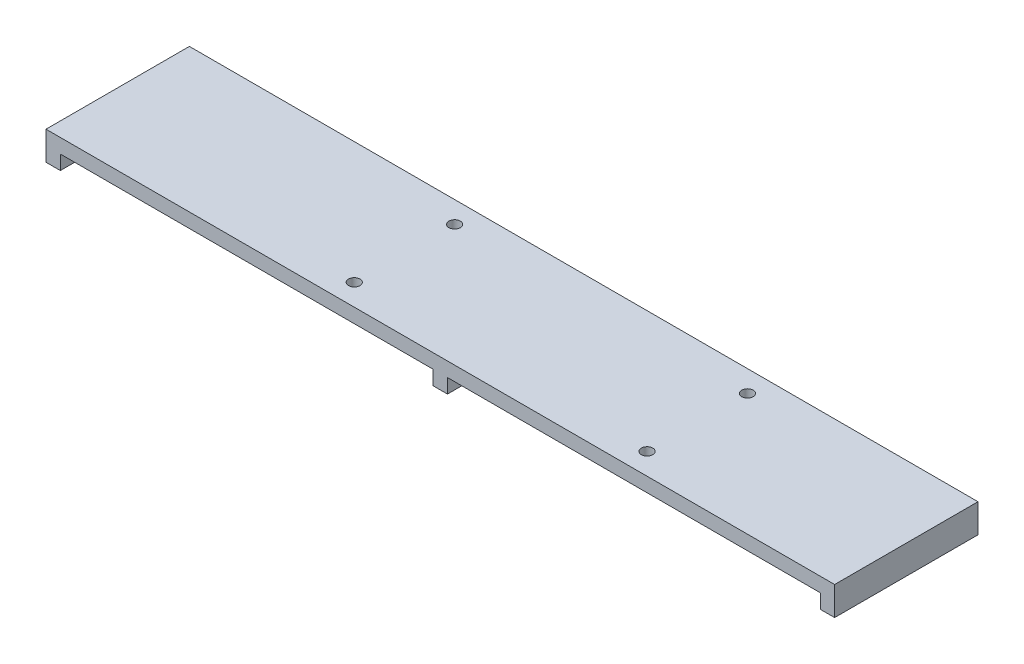
ISO-10303-21;
HEADER;
FILE_DESCRIPTION(('STEP AP214'),'2;1');
FILE_NAME('part.step','',(''),(''),'','','');
FILE_SCHEMA(('AUTOMOTIVE_DESIGN { 1 0 10303 214 1 1 1 1 }'));
ENDSEC;
DATA;
#1=APPLICATION_CONTEXT('core data for automotive mechanical design processes');
#2=APPLICATION_PROTOCOL_DEFINITION('international standard','automotive_design',2000,#1);
#3=PRODUCT_CONTEXT('',#1,'mechanical');
#4=PRODUCT('Part','Part','',(#3));
#5=PRODUCT_RELATED_PRODUCT_CATEGORY('part','',(#4));
#6=PRODUCT_DEFINITION_FORMATION('','',#4);
#7=PRODUCT_DEFINITION_CONTEXT('part definition',#1,'design');
#8=PRODUCT_DEFINITION('design','',#6,#7);
#9=PRODUCT_DEFINITION_SHAPE('','',#8);
#10=(LENGTH_UNIT() NAMED_UNIT(*) SI_UNIT(.MILLI.,.METRE.));
#11=(NAMED_UNIT(*) PLANE_ANGLE_UNIT() SI_UNIT($,.RADIAN.));
#12=(NAMED_UNIT(*) SI_UNIT($,.STERADIAN.) SOLID_ANGLE_UNIT());
#13=UNCERTAINTY_MEASURE_WITH_UNIT(LENGTH_MEASURE(1.E-05),#10,'distance_accuracy_value','');
#14=(GEOMETRIC_REPRESENTATION_CONTEXT(3) GLOBAL_UNCERTAINTY_ASSIGNED_CONTEXT((#13)) GLOBAL_UNIT_ASSIGNED_CONTEXT((#10,
#11,#12)) REPRESENTATION_CONTEXT('',''));
#15=CARTESIAN_POINT('',(0.,0.,0.));
#16=DIRECTION('',(0.,0.,1.));
#17=DIRECTION('',(1.,0.,0.));
#18=AXIS2_PLACEMENT_3D('',#15,#16,#17);
#19=CARTESIAN_POINT('',(0.,0.,-100.));
#20=DIRECTION('',(0.,-1.,0.));
#21=DIRECTION('',(0.,0.,-1.));
#22=AXIS2_PLACEMENT_3D('',#19,#20,#21);
#23=PLANE('',#22);
#24=CARTESIAN_POINT('',(200.,0.,-85.));
#25=DIRECTION('',(0.,1.,0.));
#26=DIRECTION('',(0.,0.,1.));
#27=AXIS2_PLACEMENT_3D('',#24,#25,#26);
#28=CIRCLE('',#27,3.99999999999999);
#29=CARTESIAN_POINT('',(200.,0.,-81.));
#30=VERTEX_POINT('',#29);
#31=EDGE_CURVE('E232',#30,#30,#28,.T.);
#32=ORIENTED_EDGE('',*,*,#31,.T.);
#33=EDGE_LOOP('',(#32));
#34=FACE_BOUND('',#33,.T.);
#35=CARTESIAN_POINT('',(200.,0.,-15.));
#36=DIRECTION('',(0.,1.,0.));
#37=DIRECTION('',(0.,0.,1.));
#38=AXIS2_PLACEMENT_3D('',#35,#36,#37);
#39=CIRCLE('',#38,3.99999999999999);
#40=CARTESIAN_POINT('',(200.,0.,-11.));
#41=VERTEX_POINT('',#40);
#42=EDGE_CURVE('E239',#41,#41,#39,.T.);
#43=ORIENTED_EDGE('',*,*,#42,.T.);
#44=EDGE_LOOP('',(#43));
#45=FACE_BOUND('',#44,.T.);
#46=DIRECTION('',(-1.,0.,0.));
#47=VECTOR('',#46,1.);
#48=CARTESIAN_POINT('',(0.,0.,-100.));
#49=LINE('',#48,#47);
#50=CARTESIAN_POINT('',(270.,0.,-100.));
#51=VERTEX_POINT('',#50);
#52=CARTESIAN_POINT('',(10.,0.,-100.));
#53=VERTEX_POINT('',#52);
#54=EDGE_CURVE('E196',#51,#53,#49,.T.);
#55=ORIENTED_EDGE('',*,*,#54,.F.);
#56=DIRECTION('',(0.,0.,-1.));
#57=VECTOR('',#56,1.);
#58=CARTESIAN_POINT('',(270.,0.,0.));
#59=LINE('',#58,#57);
#60=CARTESIAN_POINT('',(270.,0.,0.));
#61=VERTEX_POINT('',#60);
#62=EDGE_CURVE('E48',#61,#51,#59,.T.);
#63=ORIENTED_EDGE('',*,*,#62,.F.);
#64=DIRECTION('',(1.,0.,0.));
#65=VECTOR('',#64,1.);
#66=CARTESIAN_POINT('',(0.,0.,0.));
#67=LINE('',#66,#65);
#68=CARTESIAN_POINT('',(10.,0.,0.));
#69=VERTEX_POINT('',#68);
#70=EDGE_CURVE('E182',#69,#61,#67,.T.);
#71=ORIENTED_EDGE('',*,*,#70,.F.);
#72=DIRECTION('',(0.,0.,1.));
#73=VECTOR('',#72,1.);
#74=CARTESIAN_POINT('',(10.,0.,0.));
#75=LINE('',#74,#73);
#76=EDGE_CURVE('E162',#53,#69,#75,.T.);
#77=ORIENTED_EDGE('',*,*,#76,.F.);
#78=EDGE_LOOP('',(#55,#63,#71,#77));
#79=FACE_BOUND('',#78,.T.);
#80=ADVANCED_FACE('F30',(#34,#45,#79),#23,.T.);
#81=CARTESIAN_POINT('',(404.2,0.,-15.));
#82=DIRECTION('',(0.,1.,0.));
#83=DIRECTION('',(0.,0.,1.));
#84=AXIS2_PLACEMENT_3D('',#81,#82,#83);
#85=CIRCLE('',#84,3.99999999999999);
#86=CARTESIAN_POINT('',(404.2,0.,-11.));
#87=VERTEX_POINT('',#86);
#88=EDGE_CURVE('E245',#87,#87,#85,.T.);
#89=ORIENTED_EDGE('',*,*,#88,.T.);
#90=EDGE_LOOP('',(#89));
#91=FACE_BOUND('',#90,.T.);
#92=CARTESIAN_POINT('',(404.2,0.,-85.));
#93=DIRECTION('',(0.,1.,0.));
#94=DIRECTION('',(0.,0.,1.));
#95=AXIS2_PLACEMENT_3D('',#92,#93,#94);
#96=CIRCLE('',#95,3.99999999999999);
#97=CARTESIAN_POINT('',(404.2,0.,-81.));
#98=VERTEX_POINT('',#97);
#99=EDGE_CURVE('E190',#98,#98,#96,.T.);
#100=ORIENTED_EDGE('',*,*,#99,.T.);
#101=EDGE_LOOP('',(#100));
#102=FACE_BOUND('',#101,.T.);
#103=CARTESIAN_POINT('',(280.,0.,0.));
#104=VERTEX_POINT('',#103);
#105=CARTESIAN_POINT('',(540.,0.,0.));
#106=VERTEX_POINT('',#105);
#107=EDGE_CURVE('E34',#104,#106,#67,.T.);
#108=ORIENTED_EDGE('',*,*,#107,.F.);
#109=DIRECTION('',(0.,0.,1.));
#110=VECTOR('',#109,1.);
#111=CARTESIAN_POINT('',(280.,0.,0.));
#112=LINE('',#111,#110);
#113=CARTESIAN_POINT('',(280.,0.,-100.));
#114=VERTEX_POINT('',#113);
#115=EDGE_CURVE('E138',#114,#104,#112,.T.);
#116=ORIENTED_EDGE('',*,*,#115,.F.);
#117=CARTESIAN_POINT('',(540.,0.,-100.));
#118=VERTEX_POINT('',#117);
#119=EDGE_CURVE('E193',#118,#114,#49,.T.);
#120=ORIENTED_EDGE('',*,*,#119,.F.);
#121=DIRECTION('',(0.,0.,-1.));
#122=VECTOR('',#121,1.);
#123=CARTESIAN_POINT('',(540.,0.,0.));
#124=LINE('',#123,#122);
#125=EDGE_CURVE('E141',#106,#118,#124,.T.);
#126=ORIENTED_EDGE('',*,*,#125,.F.);
#127=EDGE_LOOP('',(#108,#116,#120,#126));
#128=FACE_BOUND('',#127,.T.);
#129=ADVANCED_FACE('F260',(#91,#102,#128),#23,.T.);
#130=CARTESIAN_POINT('',(0.,10.,-100.));
#131=DIRECTION('',(0.,-1.,0.));
#132=DIRECTION('',(0.,0.,-1.));
#133=AXIS2_PLACEMENT_3D('',#130,#131,#132);
#134=PLANE('',#133);
#135=CARTESIAN_POINT('',(404.2,10.,-15.));
#136=DIRECTION('',(0.,1.,0.));
#137=DIRECTION('',(0.,0.,1.));
#138=AXIS2_PLACEMENT_3D('',#135,#136,#137);
#139=CIRCLE('',#138,3.99999999999999);
#140=CARTESIAN_POINT('',(404.2,10.,-11.));
#141=VERTEX_POINT('',#140);
#142=EDGE_CURVE('E242',#141,#141,#139,.T.);
#143=ORIENTED_EDGE('',*,*,#142,.F.);
#144=EDGE_LOOP('',(#143));
#145=FACE_BOUND('',#144,.T.);
#146=CARTESIAN_POINT('',(200.,10.,-85.));
#147=DIRECTION('',(0.,1.,0.));
#148=DIRECTION('',(0.,0.,1.));
#149=AXIS2_PLACEMENT_3D('',#146,#147,#148);
#150=CIRCLE('',#149,3.99999999999999);
#151=CARTESIAN_POINT('',(200.,10.,-81.));
#152=VERTEX_POINT('',#151);
#153=EDGE_CURVE('E235',#152,#152,#150,.T.);
#154=ORIENTED_EDGE('',*,*,#153,.F.);
#155=EDGE_LOOP('',(#154));
#156=FACE_BOUND('',#155,.T.);
#157=DIRECTION('',(0.,0.,1.));
#158=VECTOR('',#157,1.);
#159=CARTESIAN_POINT('',(0.,10.,0.));
#160=LINE('',#159,#158);
#161=CARTESIAN_POINT('',(0.,10.,-100.));
#162=VERTEX_POINT('',#161);
#163=CARTESIAN_POINT('',(0.,10.,0.));
#164=VERTEX_POINT('',#163);
#165=EDGE_CURVE('E195',#162,#164,#160,.T.);
#166=ORIENTED_EDGE('',*,*,#165,.T.);
#167=DIRECTION('',(1.,0.,0.));
#168=VECTOR('',#167,1.);
#169=CARTESIAN_POINT('',(0.,10.,0.));
#170=LINE('',#169,#168);
#171=CARTESIAN_POINT('',(550.,10.,0.));
#172=VERTEX_POINT('',#171);
#173=EDGE_CURVE('E227',#164,#172,#170,.T.);
#174=ORIENTED_EDGE('',*,*,#173,.T.);
#175=DIRECTION('',(0.,0.,-1.));
#176=VECTOR('',#175,1.);
#177=CARTESIAN_POINT('',(550.,10.,0.));
#178=LINE('',#177,#176);
#179=CARTESIAN_POINT('',(550.,10.,-100.));
#180=VERTEX_POINT('',#179);
#181=EDGE_CURVE('E214',#172,#180,#178,.T.);
#182=ORIENTED_EDGE('',*,*,#181,.T.);
#183=DIRECTION('',(-1.,0.,0.));
#184=VECTOR('',#183,1.);
#185=CARTESIAN_POINT('',(0.,10.,-100.));
#186=LINE('',#185,#184);
#187=EDGE_CURVE('E205',#180,#162,#186,.T.);
#188=ORIENTED_EDGE('',*,*,#187,.T.);
#189=EDGE_LOOP('',(#166,#174,#182,#188));
#190=FACE_BOUND('',#189,.T.);
#191=CARTESIAN_POINT('',(200.,10.,-15.));
#192=DIRECTION('',(0.,1.,0.));
#193=DIRECTION('',(0.,0.,1.));
#194=AXIS2_PLACEMENT_3D('',#191,#192,#193);
#195=CIRCLE('',#194,3.99999999999999);
#196=CARTESIAN_POINT('',(200.,10.,-11.));
#197=VERTEX_POINT('',#196);
#198=EDGE_CURVE('E236',#197,#197,#195,.T.);
#199=ORIENTED_EDGE('',*,*,#198,.F.);
#200=EDGE_LOOP('',(#199));
#201=FACE_BOUND('',#200,.T.);
#202=CARTESIAN_POINT('',(404.2,10.,-85.));
#203=DIRECTION('',(0.,1.,0.));
#204=DIRECTION('',(0.,0.,1.));
#205=AXIS2_PLACEMENT_3D('',#202,#203,#204);
#206=CIRCLE('',#205,3.99999999999999);
#207=CARTESIAN_POINT('',(404.2,10.,-81.));
#208=VERTEX_POINT('',#207);
#209=EDGE_CURVE('E176',#208,#208,#206,.T.);
#210=ORIENTED_EDGE('',*,*,#209,.F.);
#211=EDGE_LOOP('',(#210));
#212=FACE_BOUND('',#211,.T.);
#213=ADVANCED_FACE('F258',(#145,#156,#190,#201,#212),#134,.F.);
#214=CARTESIAN_POINT('',(0.,10.,0.));
#215=DIRECTION('',(1.,0.,0.));
#216=DIRECTION('',(0.,0.,-1.));
#217=AXIS2_PLACEMENT_3D('',#214,#215,#216);
#218=PLANE('',#217);
#219=DIRECTION('',(0.,-1.,0.));
#220=VECTOR('',#219,1.);
#221=CARTESIAN_POINT('',(0.,10.,-100.));
#222=LINE('',#221,#220);
#223=CARTESIAN_POINT('',(0.,-10.,-100.));
#224=VERTEX_POINT('',#223);
#225=EDGE_CURVE('E201',#162,#224,#222,.T.);
#226=ORIENTED_EDGE('',*,*,#225,.T.);
#227=DIRECTION('',(0.,0.,-1.));
#228=VECTOR('',#227,1.);
#229=CARTESIAN_POINT('',(0.,-10.,0.));
#230=LINE('',#229,#228);
#231=CARTESIAN_POINT('',(0.,-10.,0.));
#232=VERTEX_POINT('',#231);
#233=EDGE_CURVE('E163',#232,#224,#230,.T.);
#234=ORIENTED_EDGE('',*,*,#233,.F.);
#235=DIRECTION('',(0.,-1.,0.));
#236=VECTOR('',#235,1.);
#237=CARTESIAN_POINT('',(0.,10.,0.));
#238=LINE('',#237,#236);
#239=EDGE_CURVE('E11',#164,#232,#238,.T.);
#240=ORIENTED_EDGE('',*,*,#239,.F.);
#241=ORIENTED_EDGE('',*,*,#165,.F.);
#242=EDGE_LOOP('',(#226,#234,#240,#241));
#243=FACE_BOUND('',#242,.T.);
#244=ADVANCED_FACE('F32',(#243),#218,.F.);
#245=CARTESIAN_POINT('',(0.,10.,0.));
#246=DIRECTION('',(0.,0.,-1.));
#247=DIRECTION('',(-1.,0.,0.));
#248=AXIS2_PLACEMENT_3D('',#245,#246,#247);
#249=PLANE('',#248);
#250=ORIENTED_EDGE('',*,*,#239,.T.);
#251=DIRECTION('',(-1.,0.,0.));
#252=VECTOR('',#251,1.);
#253=CARTESIAN_POINT('',(0.,-10.,0.));
#254=LINE('',#253,#252);
#255=CARTESIAN_POINT('',(10.,-10.,0.));
#256=VERTEX_POINT('',#255);
#257=EDGE_CURVE('E170',#256,#232,#254,.T.);
#258=ORIENTED_EDGE('',*,*,#257,.F.);
#259=DIRECTION('',(0.,1.,0.));
#260=VECTOR('',#259,1.);
#261=CARTESIAN_POINT('',(10.,-10.,0.));
#262=LINE('',#261,#260);
#263=EDGE_CURVE('E173',#256,#69,#262,.T.);
#264=ORIENTED_EDGE('',*,*,#263,.T.);
#265=ORIENTED_EDGE('',*,*,#70,.T.);
#266=DIRECTION('',(0.,1.,0.));
#267=VECTOR('',#266,1.);
#268=CARTESIAN_POINT('',(270.,-10.,0.));
#269=LINE('',#268,#267);
#270=CARTESIAN_POINT('',(270.,-10.,0.));
#271=VERTEX_POINT('',#270);
#272=EDGE_CURVE('E453',#271,#61,#269,.T.);
#273=ORIENTED_EDGE('',*,*,#272,.F.);
#274=DIRECTION('',(-1.,0.,0.));
#275=VECTOR('',#274,1.);
#276=CARTESIAN_POINT('',(270.,-10.,0.));
#277=LINE('',#276,#275);
#278=CARTESIAN_POINT('',(280.,-10.,0.));
#279=VERTEX_POINT('',#278);
#280=EDGE_CURVE('E136',#279,#271,#277,.T.);
#281=ORIENTED_EDGE('',*,*,#280,.F.);
#282=DIRECTION('',(0.,1.,0.));
#283=VECTOR('',#282,1.);
#284=CARTESIAN_POINT('',(280.,-10.,0.));
#285=LINE('',#284,#283);
#286=EDGE_CURVE('E145',#279,#104,#285,.T.);
#287=ORIENTED_EDGE('',*,*,#286,.T.);
#288=ORIENTED_EDGE('',*,*,#107,.T.);
#289=DIRECTION('',(0.,1.,0.));
#290=VECTOR('',#289,1.);
#291=CARTESIAN_POINT('',(540.,-10.,0.));
#292=LINE('',#291,#290);
#293=CARTESIAN_POINT('',(540.,-10.,0.));
#294=VERTEX_POINT('',#293);
#295=EDGE_CURVE('E159',#294,#106,#292,.T.);
#296=ORIENTED_EDGE('',*,*,#295,.F.);
#297=DIRECTION('',(-1.,0.,0.));
#298=VECTOR('',#297,1.);
#299=CARTESIAN_POINT('',(550.,-10.,0.));
#300=LINE('',#299,#298);
#301=CARTESIAN_POINT('',(550.,-10.,0.));
#302=VERTEX_POINT('',#301);
#303=EDGE_CURVE('E151',#302,#294,#300,.T.);
#304=ORIENTED_EDGE('',*,*,#303,.F.);
#305=DIRECTION('',(0.,-1.,0.));
#306=VECTOR('',#305,1.);
#307=CARTESIAN_POINT('',(550.,10.,0.));
#308=LINE('',#307,#306);
#309=EDGE_CURVE('E40',#172,#302,#308,.T.);
#310=ORIENTED_EDGE('',*,*,#309,.F.);
#311=ORIENTED_EDGE('',*,*,#173,.F.);
#312=EDGE_LOOP('',(#250,#258,#264,#265,#273,#281,#287,#288,#296,#304,#310,#311));
#313=FACE_BOUND('',#312,.T.);
#314=ADVANCED_FACE('F217',(#313),#249,.F.);
#315=CARTESIAN_POINT('',(550.,10.,0.));
#316=DIRECTION('',(-1.,0.,0.));
#317=DIRECTION('',(0.,0.,1.));
#318=AXIS2_PLACEMENT_3D('',#315,#316,#317);
#319=PLANE('',#318);
#320=ORIENTED_EDGE('',*,*,#309,.T.);
#321=DIRECTION('',(0.,0.,1.));
#322=VECTOR('',#321,1.);
#323=CARTESIAN_POINT('',(550.,-10.,0.));
#324=LINE('',#323,#322);
#325=CARTESIAN_POINT('',(550.,-10.,-100.));
#326=VERTEX_POINT('',#325);
#327=EDGE_CURVE('E143',#326,#302,#324,.T.);
#328=ORIENTED_EDGE('',*,*,#327,.F.);
#329=DIRECTION('',(0.,-1.,0.));
#330=VECTOR('',#329,1.);
#331=CARTESIAN_POINT('',(550.,10.,-100.));
#332=LINE('',#331,#330);
#333=EDGE_CURVE('E204',#180,#326,#332,.T.);
#334=ORIENTED_EDGE('',*,*,#333,.F.);
#335=ORIENTED_EDGE('',*,*,#181,.F.);
#336=EDGE_LOOP('',(#320,#328,#334,#335));
#337=FACE_BOUND('',#336,.T.);
#338=ADVANCED_FACE('F212',(#337),#319,.F.);
#339=CARTESIAN_POINT('',(0.,10.,-100.));
#340=DIRECTION('',(0.,0.,1.));
#341=DIRECTION('',(1.,0.,0.));
#342=AXIS2_PLACEMENT_3D('',#339,#340,#341);
#343=PLANE('',#342);
#344=ORIENTED_EDGE('',*,*,#333,.T.);
#345=DIRECTION('',(1.,0.,0.));
#346=VECTOR('',#345,1.);
#347=CARTESIAN_POINT('',(550.,-10.,-100.));
#348=LINE('',#347,#346);
#349=CARTESIAN_POINT('',(540.,-10.,-100.));
#350=VERTEX_POINT('',#349);
#351=EDGE_CURVE('E155',#350,#326,#348,.T.);
#352=ORIENTED_EDGE('',*,*,#351,.F.);
#353=DIRECTION('',(0.,1.,0.));
#354=VECTOR('',#353,1.);
#355=CARTESIAN_POINT('',(540.,-10.,-100.));
#356=LINE('',#355,#354);
#357=EDGE_CURVE('E56',#350,#118,#356,.T.);
#358=ORIENTED_EDGE('',*,*,#357,.T.);
#359=ORIENTED_EDGE('',*,*,#119,.T.);
#360=DIRECTION('',(0.,1.,0.));
#361=VECTOR('',#360,1.);
#362=CARTESIAN_POINT('',(280.,-10.,-100.));
#363=LINE('',#362,#361);
#364=CARTESIAN_POINT('',(280.,-10.,-100.));
#365=VERTEX_POINT('',#364);
#366=EDGE_CURVE('E127',#365,#114,#363,.T.);
#367=ORIENTED_EDGE('',*,*,#366,.F.);
#368=DIRECTION('',(1.,0.,0.));
#369=VECTOR('',#368,1.);
#370=CARTESIAN_POINT('',(270.,-10.,-100.));
#371=LINE('',#370,#369);
#372=CARTESIAN_POINT('',(270.,-10.,-100.));
#373=VERTEX_POINT('',#372);
#374=EDGE_CURVE('E122',#373,#365,#371,.T.);
#375=ORIENTED_EDGE('',*,*,#374,.F.);
#376=DIRECTION('',(0.,1.,0.));
#377=VECTOR('',#376,1.);
#378=CARTESIAN_POINT('',(270.,-10.,-100.));
#379=LINE('',#378,#377);
#380=EDGE_CURVE('E125',#373,#51,#379,.T.);
#381=ORIENTED_EDGE('',*,*,#380,.T.);
#382=ORIENTED_EDGE('',*,*,#54,.T.);
#383=DIRECTION('',(0.,1.,0.));
#384=VECTOR('',#383,1.);
#385=CARTESIAN_POINT('',(10.,-10.,-100.));
#386=LINE('',#385,#384);
#387=CARTESIAN_POINT('',(10.,-10.,-100.));
#388=VERTEX_POINT('',#387);
#389=EDGE_CURVE('E185',#388,#53,#386,.T.);
#390=ORIENTED_EDGE('',*,*,#389,.F.);
#391=DIRECTION('',(1.,0.,0.));
#392=VECTOR('',#391,1.);
#393=CARTESIAN_POINT('',(0.,-10.,-100.));
#394=LINE('',#393,#392);
#395=EDGE_CURVE('E166',#224,#388,#394,.T.);
#396=ORIENTED_EDGE('',*,*,#395,.F.);
#397=ORIENTED_EDGE('',*,*,#225,.F.);
#398=ORIENTED_EDGE('',*,*,#187,.F.);
#399=EDGE_LOOP('',(#344,#352,#358,#359,#367,#375,#381,#382,#390,#396,#397,#398));
#400=FACE_BOUND('',#399,.T.);
#401=ADVANCED_FACE('F124',(#400),#343,.F.);
#402=CARTESIAN_POINT('',(200.,10.,-85.));
#403=DIRECTION('',(0.,-1.,0.));
#404=DIRECTION('',(0.,0.,-1.));
#405=AXIS2_PLACEMENT_3D('',#402,#403,#404);
#406=CYLINDRICAL_SURFACE('',#405,3.99999999999999);
#407=ORIENTED_EDGE('',*,*,#153,.T.);
#408=EDGE_LOOP('',(#407));
#409=FACE_BOUND('',#408,.T.);
#410=ORIENTED_EDGE('',*,*,#31,.F.);
#411=EDGE_LOOP('',(#410));
#412=FACE_BOUND('',#411,.T.);
#413=ADVANCED_FACE('F281',(#409,#412),#406,.F.);
#414=CARTESIAN_POINT('',(200.,10.,-15.));
#415=DIRECTION('',(0.,-1.,0.));
#416=DIRECTION('',(0.,0.,-1.));
#417=AXIS2_PLACEMENT_3D('',#414,#415,#416);
#418=CYLINDRICAL_SURFACE('',#417,3.99999999999999);
#419=ORIENTED_EDGE('',*,*,#198,.T.);
#420=EDGE_LOOP('',(#419));
#421=FACE_BOUND('',#420,.T.);
#422=ORIENTED_EDGE('',*,*,#42,.F.);
#423=EDGE_LOOP('',(#422));
#424=FACE_BOUND('',#423,.T.);
#425=ADVANCED_FACE('F303',(#421,#424),#418,.F.);
#426=CARTESIAN_POINT('',(404.2,10.,-15.));
#427=DIRECTION('',(0.,-1.,0.));
#428=DIRECTION('',(0.,0.,-1.));
#429=AXIS2_PLACEMENT_3D('',#426,#427,#428);
#430=CYLINDRICAL_SURFACE('',#429,3.99999999999999);
#431=ORIENTED_EDGE('',*,*,#142,.T.);
#432=EDGE_LOOP('',(#431));
#433=FACE_BOUND('',#432,.T.);
#434=ORIENTED_EDGE('',*,*,#88,.F.);
#435=EDGE_LOOP('',(#434));
#436=FACE_BOUND('',#435,.T.);
#437=ADVANCED_FACE('F310',(#433,#436),#430,.F.);
#438=CARTESIAN_POINT('',(404.2,10.,-85.));
#439=DIRECTION('',(0.,-1.,0.));
#440=DIRECTION('',(0.,0.,-1.));
#441=AXIS2_PLACEMENT_3D('',#438,#439,#440);
#442=CYLINDRICAL_SURFACE('',#441,3.99999999999999);
#443=ORIENTED_EDGE('',*,*,#209,.T.);
#444=EDGE_LOOP('',(#443));
#445=FACE_BOUND('',#444,.T.);
#446=ORIENTED_EDGE('',*,*,#99,.F.);
#447=EDGE_LOOP('',(#446));
#448=FACE_BOUND('',#447,.T.);
#449=ADVANCED_FACE('F255',(#445,#448),#442,.F.);
#450=CARTESIAN_POINT('',(10.,-10.,0.));
#451=DIRECTION('',(-1.,0.,0.));
#452=DIRECTION('',(0.,0.,1.));
#453=AXIS2_PLACEMENT_3D('',#450,#451,#452);
#454=PLANE('',#453);
#455=ORIENTED_EDGE('',*,*,#76,.T.);
#456=ORIENTED_EDGE('',*,*,#263,.F.);
#457=DIRECTION('',(0.,0.,1.));
#458=VECTOR('',#457,1.);
#459=CARTESIAN_POINT('',(10.,-10.,0.));
#460=LINE('',#459,#458);
#461=EDGE_CURVE('E168',#388,#256,#460,.T.);
#462=ORIENTED_EDGE('',*,*,#461,.F.);
#463=ORIENTED_EDGE('',*,*,#389,.T.);
#464=EDGE_LOOP('',(#455,#456,#462,#463));
#465=FACE_BOUND('',#464,.T.);
#466=ADVANCED_FACE('F325',(#465),#454,.F.);
#467=CARTESIAN_POINT('',(0.,-10.,-100.));
#468=DIRECTION('',(0.,-1.,0.));
#469=DIRECTION('',(0.,0.,-1.));
#470=AXIS2_PLACEMENT_3D('',#467,#468,#469);
#471=PLANE('',#470);
#472=ORIENTED_EDGE('',*,*,#233,.T.);
#473=ORIENTED_EDGE('',*,*,#395,.T.);
#474=ORIENTED_EDGE('',*,*,#461,.T.);
#475=ORIENTED_EDGE('',*,*,#257,.T.);
#476=EDGE_LOOP('',(#472,#473,#474,#475));
#477=FACE_BOUND('',#476,.T.);
#478=ADVANCED_FACE('F331',(#477),#471,.T.);
#479=CARTESIAN_POINT('',(540.,-10.,0.));
#480=DIRECTION('',(1.,0.,0.));
#481=DIRECTION('',(0.,0.,-1.));
#482=AXIS2_PLACEMENT_3D('',#479,#480,#481);
#483=PLANE('',#482);
#484=ORIENTED_EDGE('',*,*,#125,.T.);
#485=ORIENTED_EDGE('',*,*,#357,.F.);
#486=DIRECTION('',(0.,0.,-1.));
#487=VECTOR('',#486,1.);
#488=CARTESIAN_POINT('',(540.,-10.,0.));
#489=LINE('',#488,#487);
#490=EDGE_CURVE('E153',#294,#350,#489,.T.);
#491=ORIENTED_EDGE('',*,*,#490,.F.);
#492=ORIENTED_EDGE('',*,*,#295,.T.);
#493=EDGE_LOOP('',(#484,#485,#491,#492));
#494=FACE_BOUND('',#493,.T.);
#495=ADVANCED_FACE('F339',(#494),#483,.F.);
#496=CARTESIAN_POINT('',(550.,-10.,-100.));
#497=DIRECTION('',(0.,1.,0.));
#498=DIRECTION('',(0.,0.,1.));
#499=AXIS2_PLACEMENT_3D('',#496,#497,#498);
#500=PLANE('',#499);
#501=ORIENTED_EDGE('',*,*,#327,.T.);
#502=ORIENTED_EDGE('',*,*,#303,.T.);
#503=ORIENTED_EDGE('',*,*,#490,.T.);
#504=ORIENTED_EDGE('',*,*,#351,.T.);
#505=EDGE_LOOP('',(#501,#502,#503,#504));
#506=FACE_BOUND('',#505,.T.);
#507=ADVANCED_FACE('F220',(#506),#500,.F.);
#508=CARTESIAN_POINT('',(270.,-10.,0.));
#509=DIRECTION('',(1.,0.,0.));
#510=DIRECTION('',(0.,0.,-1.));
#511=AXIS2_PLACEMENT_3D('',#508,#509,#510);
#512=PLANE('',#511);
#513=ORIENTED_EDGE('',*,*,#62,.T.);
#514=ORIENTED_EDGE('',*,*,#380,.F.);
#515=DIRECTION('',(0.,0.,-1.));
#516=VECTOR('',#515,1.);
#517=CARTESIAN_POINT('',(270.,-10.,0.));
#518=LINE('',#517,#516);
#519=EDGE_CURVE('E131',#271,#373,#518,.T.);
#520=ORIENTED_EDGE('',*,*,#519,.F.);
#521=ORIENTED_EDGE('',*,*,#272,.T.);
#522=EDGE_LOOP('',(#513,#514,#520,#521));
#523=FACE_BOUND('',#522,.T.);
#524=ADVANCED_FACE('F140',(#523),#512,.F.);
#525=CARTESIAN_POINT('',(280.,-10.,0.));
#526=DIRECTION('',(-1.,0.,0.));
#527=DIRECTION('',(0.,0.,1.));
#528=AXIS2_PLACEMENT_3D('',#525,#526,#527);
#529=PLANE('',#528);
#530=ORIENTED_EDGE('',*,*,#115,.T.);
#531=ORIENTED_EDGE('',*,*,#286,.F.);
#532=DIRECTION('',(0.,0.,1.));
#533=VECTOR('',#532,1.);
#534=CARTESIAN_POINT('',(280.,-10.,0.));
#535=LINE('',#534,#533);
#536=EDGE_CURVE('E130',#365,#279,#535,.T.);
#537=ORIENTED_EDGE('',*,*,#536,.F.);
#538=ORIENTED_EDGE('',*,*,#366,.T.);
#539=EDGE_LOOP('',(#530,#531,#537,#538));
#540=FACE_BOUND('',#539,.T.);
#541=ADVANCED_FACE('F360',(#540),#529,.F.);
#542=CARTESIAN_POINT('',(270.,-10.,-100.));
#543=DIRECTION('',(0.,-1.,0.));
#544=DIRECTION('',(0.,0.,-1.));
#545=AXIS2_PLACEMENT_3D('',#542,#543,#544);
#546=PLANE('',#545);
#547=ORIENTED_EDGE('',*,*,#519,.T.);
#548=ORIENTED_EDGE('',*,*,#374,.T.);
#549=ORIENTED_EDGE('',*,*,#536,.T.);
#550=ORIENTED_EDGE('',*,*,#280,.T.);
#551=EDGE_LOOP('',(#547,#548,#549,#550));
#552=FACE_BOUND('',#551,.T.);
#553=ADVANCED_FACE('F134',(#552),#546,.T.);
#554=CLOSED_SHELL('',(#80,#129,#213,#244,#314,#338,#401,#413,#425,#437,#449,#466,#478,#495,#507,
#524,#541,#553));
#555=MANIFOLD_SOLID_BREP('B2',#554);
#556=ADVANCED_BREP_SHAPE_REPRESENTATION('',(#18,#555),#14);
#557=SHAPE_DEFINITION_REPRESENTATION(#9,#556);
ENDSEC;
END-ISO-10303-21;
